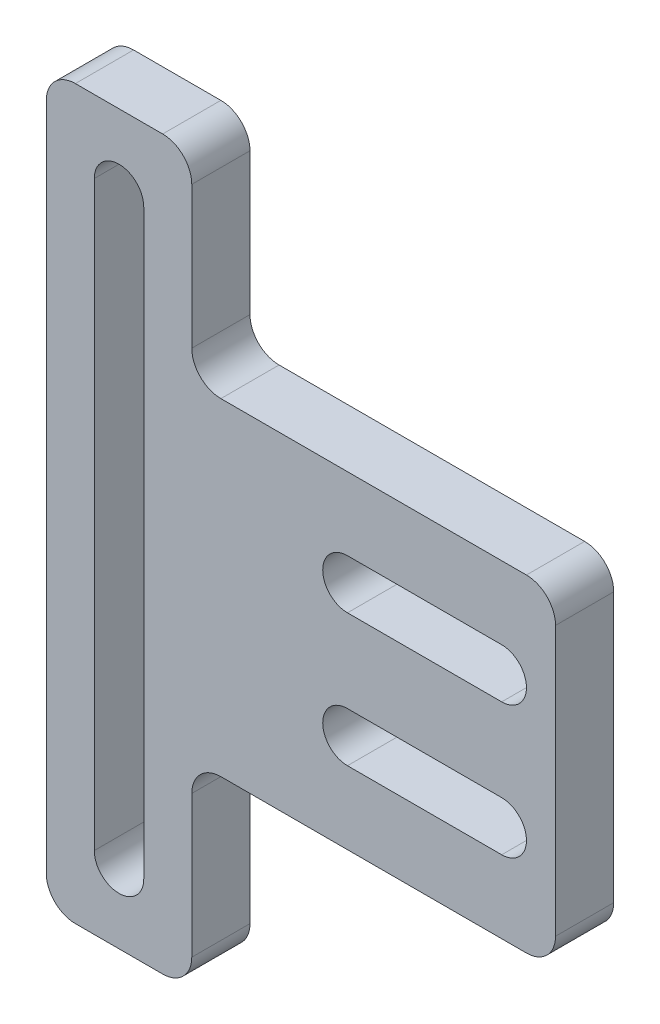
ISO-10303-21;
HEADER;
FILE_DESCRIPTION(('STEP AP214'),'2;1');
FILE_NAME('part.step','',(''),(''),'','','');
FILE_SCHEMA(('AUTOMOTIVE_DESIGN { 1 0 10303 214 1 1 1 1 }'));
ENDSEC;
DATA;
#1=APPLICATION_CONTEXT('core data for automotive mechanical design processes');
#2=APPLICATION_PROTOCOL_DEFINITION('international standard','automotive_design',2000,#1);
#3=PRODUCT_CONTEXT('',#1,'mechanical');
#4=PRODUCT('Part','Part','',(#3));
#5=PRODUCT_RELATED_PRODUCT_CATEGORY('part','',(#4));
#6=PRODUCT_DEFINITION_FORMATION('','',#4);
#7=PRODUCT_DEFINITION_CONTEXT('part definition',#1,'design');
#8=PRODUCT_DEFINITION('design','',#6,#7);
#9=PRODUCT_DEFINITION_SHAPE('','',#8);
#10=(LENGTH_UNIT() NAMED_UNIT(*) SI_UNIT(.MILLI.,.METRE.));
#11=(NAMED_UNIT(*) PLANE_ANGLE_UNIT() SI_UNIT($,.RADIAN.));
#12=(NAMED_UNIT(*) SI_UNIT($,.STERADIAN.) SOLID_ANGLE_UNIT());
#13=UNCERTAINTY_MEASURE_WITH_UNIT(LENGTH_MEASURE(1.E-05),#10,'distance_accuracy_value','');
#14=(GEOMETRIC_REPRESENTATION_CONTEXT(3) GLOBAL_UNCERTAINTY_ASSIGNED_CONTEXT((#13)) GLOBAL_UNIT_ASSIGNED_CONTEXT((#10,
#11,#12)) REPRESENTATION_CONTEXT('',''));
#15=CARTESIAN_POINT('',(0.,0.,0.));
#16=DIRECTION('',(0.,0.,1.));
#17=DIRECTION('',(1.,0.,0.));
#18=AXIS2_PLACEMENT_3D('',#15,#16,#17);
#19=CARTESIAN_POINT('',(0.,0.,2.));
#20=DIRECTION('',(0.,0.,1.));
#21=DIRECTION('',(1.,0.,0.));
#22=AXIS2_PLACEMENT_3D('',#19,#20,#21);
#23=PLANE('',#22);
#24=DIRECTION('',(0.,1.,0.));
#25=VECTOR('',#24,1.);
#26=CARTESIAN_POINT('',(-7.49999999999999,25.,2.));
#27=LINE('',#26,#25);
#28=CARTESIAN_POINT('',(-7.49999999999999,13.25,2.));
#29=VERTEX_POINT('',#28);
#30=CARTESIAN_POINT('',(-7.49999999999999,23.,2.));
#31=VERTEX_POINT('',#30);
#32=EDGE_CURVE('E393',#29,#31,#27,.T.);
#33=ORIENTED_EDGE('',*,*,#32,.T.);
#34=CARTESIAN_POINT('',(-9.49999999999999,23.,2.));
#35=DIRECTION('',(0.,0.,1.));
#36=DIRECTION('',(1.,0.,0.));
#37=AXIS2_PLACEMENT_3D('',#34,#35,#36);
#38=CIRCLE('',#37,2.);
#39=CARTESIAN_POINT('',(-9.49999999999999,25.,2.));
#40=VERTEX_POINT('',#39);
#41=EDGE_CURVE('E478',#31,#40,#38,.T.);
#42=ORIENTED_EDGE('',*,*,#41,.T.);
#43=DIRECTION('',(-1.,0.,0.));
#44=VECTOR('',#43,1.);
#45=CARTESIAN_POINT('',(-17.5,25.,2.));
#46=LINE('',#45,#44);
#47=CARTESIAN_POINT('',(-15.5,25.,2.));
#48=VERTEX_POINT('',#47);
#49=EDGE_CURVE('E397',#40,#48,#46,.T.);
#50=ORIENTED_EDGE('',*,*,#49,.T.);
#51=CARTESIAN_POINT('',(-15.5,23.,2.));
#52=DIRECTION('',(0.,0.,1.));
#53=DIRECTION('',(1.,0.,0.));
#54=AXIS2_PLACEMENT_3D('',#51,#52,#53);
#55=CIRCLE('',#54,2.);
#56=CARTESIAN_POINT('',(-17.5,23.,2.));
#57=VERTEX_POINT('',#56);
#58=EDGE_CURVE('E68',#48,#57,#55,.T.);
#59=ORIENTED_EDGE('',*,*,#58,.T.);
#60=DIRECTION('',(0.,-1.,0.));
#61=VECTOR('',#60,1.);
#62=CARTESIAN_POINT('',(-17.5,-25.,2.));
#63=LINE('',#62,#61);
#64=CARTESIAN_POINT('',(-17.5,-23.,2.));
#65=VERTEX_POINT('',#64);
#66=EDGE_CURVE('E400',#57,#65,#63,.T.);
#67=ORIENTED_EDGE('',*,*,#66,.T.);
#68=CARTESIAN_POINT('',(-15.5,-23.,2.));
#69=DIRECTION('',(0.,0.,1.));
#70=DIRECTION('',(1.,0.,0.));
#71=AXIS2_PLACEMENT_3D('',#68,#69,#70);
#72=CIRCLE('',#71,2.);
#73=CARTESIAN_POINT('',(-15.5,-25.,2.));
#74=VERTEX_POINT('',#73);
#75=EDGE_CURVE('E464',#65,#74,#72,.T.);
#76=ORIENTED_EDGE('',*,*,#75,.T.);
#77=DIRECTION('',(1.,0.,0.));
#78=VECTOR('',#77,1.);
#79=CARTESIAN_POINT('',(-17.5,-25.,2.));
#80=LINE('',#79,#78);
#81=CARTESIAN_POINT('',(-9.49999999999999,-25.,2.));
#82=VERTEX_POINT('',#81);
#83=EDGE_CURVE('E372',#74,#82,#80,.T.);
#84=ORIENTED_EDGE('',*,*,#83,.T.);
#85=CARTESIAN_POINT('',(-9.49999999999999,-23.,2.));
#86=DIRECTION('',(0.,0.,1.));
#87=DIRECTION('',(1.,0.,0.));
#88=AXIS2_PLACEMENT_3D('',#85,#86,#87);
#89=CIRCLE('',#88,2.);
#90=CARTESIAN_POINT('',(-7.49999999999999,-23.,2.));
#91=VERTEX_POINT('',#90);
#92=EDGE_CURVE('E467',#82,#91,#89,.T.);
#93=ORIENTED_EDGE('',*,*,#92,.T.);
#94=DIRECTION('',(0.,1.,0.));
#95=VECTOR('',#94,1.);
#96=CARTESIAN_POINT('',(-7.49999999999999,-25.,2.));
#97=LINE('',#96,#95);
#98=CARTESIAN_POINT('',(-7.49999999999999,-13.25,2.));
#99=VERTEX_POINT('',#98);
#100=EDGE_CURVE('E376',#91,#99,#97,.T.);
#101=ORIENTED_EDGE('',*,*,#100,.T.);
#102=CARTESIAN_POINT('',(-5.49999999999999,-13.25,2.));
#103=DIRECTION('',(0.,0.,1.));
#104=DIRECTION('',(1.,0.,0.));
#105=AXIS2_PLACEMENT_3D('',#102,#103,#104);
#106=CIRCLE('',#105,2.);
#107=CARTESIAN_POINT('',(-5.49999999999999,-11.25,2.));
#108=VERTEX_POINT('',#107);
#109=EDGE_CURVE('E525',#99,#108,#106,.F.);
#110=ORIENTED_EDGE('',*,*,#109,.T.);
#111=DIRECTION('',(1.,0.,0.));
#112=VECTOR('',#111,1.);
#113=CARTESIAN_POINT('',(17.5,-11.25,2.));
#114=LINE('',#113,#112);
#115=CARTESIAN_POINT('',(15.5,-11.25,2.));
#116=VERTEX_POINT('',#115);
#117=EDGE_CURVE('E381',#108,#116,#114,.T.);
#118=ORIENTED_EDGE('',*,*,#117,.T.);
#119=CARTESIAN_POINT('',(15.5,-9.25000000000001,2.));
#120=DIRECTION('',(0.,0.,1.));
#121=DIRECTION('',(1.,0.,0.));
#122=AXIS2_PLACEMENT_3D('',#119,#120,#121);
#123=CIRCLE('',#122,2.);
#124=CARTESIAN_POINT('',(17.5,-9.25000000000001,2.));
#125=VERTEX_POINT('',#124);
#126=EDGE_CURVE('E472',#116,#125,#123,.T.);
#127=ORIENTED_EDGE('',*,*,#126,.T.);
#128=DIRECTION('',(0.,1.,0.));
#129=VECTOR('',#128,1.);
#130=CARTESIAN_POINT('',(17.5,-11.25,2.));
#131=LINE('',#130,#129);
#132=CARTESIAN_POINT('',(17.5,9.25000000000001,2.));
#133=VERTEX_POINT('',#132);
#134=EDGE_CURVE('E385',#125,#133,#131,.T.);
#135=ORIENTED_EDGE('',*,*,#134,.T.);
#136=CARTESIAN_POINT('',(15.5,9.25000000000001,2.));
#137=DIRECTION('',(0.,0.,1.));
#138=DIRECTION('',(1.,0.,0.));
#139=AXIS2_PLACEMENT_3D('',#136,#137,#138);
#140=CIRCLE('',#139,2.);
#141=CARTESIAN_POINT('',(15.5,11.25,2.));
#142=VERTEX_POINT('',#141);
#143=EDGE_CURVE('E475',#133,#142,#140,.T.);
#144=ORIENTED_EDGE('',*,*,#143,.T.);
#145=DIRECTION('',(-1.,0.,0.));
#146=VECTOR('',#145,1.);
#147=CARTESIAN_POINT('',(17.5,11.25,2.));
#148=LINE('',#147,#146);
#149=CARTESIAN_POINT('',(-5.49999999999999,11.25,2.));
#150=VERTEX_POINT('',#149);
#151=EDGE_CURVE('E389',#142,#150,#148,.T.);
#152=ORIENTED_EDGE('',*,*,#151,.T.);
#153=CARTESIAN_POINT('',(-5.49999999999999,13.25,2.));
#154=DIRECTION('',(0.,0.,1.));
#155=DIRECTION('',(1.,0.,0.));
#156=AXIS2_PLACEMENT_3D('',#153,#154,#155);
#157=CIRCLE('',#156,2.);
#158=EDGE_CURVE('E11',#150,#29,#157,.F.);
#159=ORIENTED_EDGE('',*,*,#158,.T.);
#160=EDGE_LOOP('',(#33,#42,#50,#59,#67,#76,#84,#93,#101,#110,#118,#127,#135,#144,#152,#159));
#161=FACE_BOUND('',#160,.T.);
#162=DIRECTION('',(1.,0.,0.));
#163=VECTOR('',#162,1.);
#164=CARTESIAN_POINT('',(3.20000000000002,2.85000000000003,2.));
#165=LINE('',#164,#163);
#166=CARTESIAN_POINT('',(3.20000000000002,2.85000000000003,2.));
#167=VERTEX_POINT('',#166);
#168=CARTESIAN_POINT('',(13.8,2.85000000000003,2.));
#169=VERTEX_POINT('',#168);
#170=EDGE_CURVE('E332',#167,#169,#165,.T.);
#171=ORIENTED_EDGE('',*,*,#170,.F.);
#172=CARTESIAN_POINT('',(3.20000000000001,4.55000000000001,2.));
#173=DIRECTION('',(0.,0.,1.));
#174=DIRECTION('',(1.,0.,0.));
#175=AXIS2_PLACEMENT_3D('',#172,#173,#174);
#176=CIRCLE('',#175,1.69999999999998);
#177=CARTESIAN_POINT('',(3.20000000000002,6.24999999999999,2.));
#178=VERTEX_POINT('',#177);
#179=EDGE_CURVE('E329',#178,#167,#176,.T.);
#180=ORIENTED_EDGE('',*,*,#179,.F.);
#181=DIRECTION('',(-1.,0.,0.));
#182=VECTOR('',#181,1.);
#183=CARTESIAN_POINT('',(3.20000000000002,6.24999999999999,2.));
#184=LINE('',#183,#182);
#185=CARTESIAN_POINT('',(13.8,6.24999999999999,2.));
#186=VERTEX_POINT('',#185);
#187=EDGE_CURVE('E340',#186,#178,#184,.T.);
#188=ORIENTED_EDGE('',*,*,#187,.F.);
#189=CARTESIAN_POINT('',(13.8,4.55000000000001,2.));
#190=DIRECTION('',(0.,0.,1.));
#191=DIRECTION('',(1.,0.,0.));
#192=AXIS2_PLACEMENT_3D('',#189,#190,#191);
#193=CIRCLE('',#192,1.69999999999998);
#194=EDGE_CURVE('E336',#169,#186,#193,.T.);
#195=ORIENTED_EDGE('',*,*,#194,.F.);
#196=EDGE_LOOP('',(#171,#180,#188,#195));
#197=FACE_BOUND('',#196,.T.);
#198=DIRECTION('',(1.,0.,0.));
#199=VECTOR('',#198,1.);
#200=CARTESIAN_POINT('',(3.20000000000002,-6.24999999999999,2.));
#201=LINE('',#200,#199);
#202=CARTESIAN_POINT('',(3.20000000000002,-6.24999999999999,2.));
#203=VERTEX_POINT('',#202);
#204=CARTESIAN_POINT('',(13.8,-6.24999999999999,2.));
#205=VERTEX_POINT('',#204);
#206=EDGE_CURVE('E289',#203,#205,#201,.T.);
#207=ORIENTED_EDGE('',*,*,#206,.F.);
#208=CARTESIAN_POINT('',(3.20000000000001,-4.54999999999999,2.));
#209=DIRECTION('',(0.,0.,1.));
#210=DIRECTION('',(-1.,0.,0.));
#211=AXIS2_PLACEMENT_3D('',#208,#209,#210);
#212=CIRCLE('',#211,1.69999999999998);
#213=CARTESIAN_POINT('',(3.20000000000002,-2.85000000000003,2.));
#214=VERTEX_POINT('',#213);
#215=EDGE_CURVE('E286',#214,#203,#212,.T.);
#216=ORIENTED_EDGE('',*,*,#215,.F.);
#217=DIRECTION('',(-1.,0.,0.));
#218=VECTOR('',#217,1.);
#219=CARTESIAN_POINT('',(3.20000000000002,-2.85000000000003,2.));
#220=LINE('',#219,#218);
#221=CARTESIAN_POINT('',(13.8,-2.85000000000002,2.));
#222=VERTEX_POINT('',#221);
#223=EDGE_CURVE('E297',#222,#214,#220,.T.);
#224=ORIENTED_EDGE('',*,*,#223,.F.);
#225=CARTESIAN_POINT('',(13.8,-4.54999999999999,2.));
#226=DIRECTION('',(0.,0.,1.));
#227=DIRECTION('',(-1.,0.,0.));
#228=AXIS2_PLACEMENT_3D('',#225,#226,#227);
#229=CIRCLE('',#228,1.69999999999998);
#230=EDGE_CURVE('E293',#205,#222,#229,.T.);
#231=ORIENTED_EDGE('',*,*,#230,.F.);
#232=EDGE_LOOP('',(#207,#216,#224,#231));
#233=FACE_BOUND('',#232,.T.);
#234=DIRECTION('',(0.,-1.,0.));
#235=VECTOR('',#234,1.);
#236=CARTESIAN_POINT('',(-14.2,20.,2.));
#237=LINE('',#236,#235);
#238=CARTESIAN_POINT('',(-14.2,20.,2.));
#239=VERTEX_POINT('',#238);
#240=CARTESIAN_POINT('',(-14.2,-20.,2.));
#241=VERTEX_POINT('',#240);
#242=EDGE_CURVE('E244',#239,#241,#237,.T.);
#243=ORIENTED_EDGE('',*,*,#242,.F.);
#244=CARTESIAN_POINT('',(-12.5,20.,2.));
#245=DIRECTION('',(0.,0.,1.));
#246=DIRECTION('',(1.,0.,0.));
#247=AXIS2_PLACEMENT_3D('',#244,#245,#246);
#248=CIRCLE('',#247,1.7);
#249=CARTESIAN_POINT('',(-10.8,20.,2.));
#250=VERTEX_POINT('',#249);
#251=EDGE_CURVE('E233',#250,#239,#248,.T.);
#252=ORIENTED_EDGE('',*,*,#251,.F.);
#253=DIRECTION('',(0.,1.,0.));
#254=VECTOR('',#253,1.);
#255=CARTESIAN_POINT('',(-10.8,20.,2.));
#256=LINE('',#255,#254);
#257=CARTESIAN_POINT('',(-10.8,-20.,2.));
#258=VERTEX_POINT('',#257);
#259=EDGE_CURVE('E262',#258,#250,#256,.T.);
#260=ORIENTED_EDGE('',*,*,#259,.F.);
#261=CARTESIAN_POINT('',(-12.5,-20.,2.));
#262=DIRECTION('',(0.,0.,1.));
#263=DIRECTION('',(1.,0.,0.));
#264=AXIS2_PLACEMENT_3D('',#261,#262,#263);
#265=CIRCLE('',#264,1.7);
#266=EDGE_CURVE('E258',#241,#258,#265,.T.);
#267=ORIENTED_EDGE('',*,*,#266,.F.);
#268=EDGE_LOOP('',(#243,#252,#260,#267));
#269=FACE_BOUND('',#268,.T.);
#270=ADVANCED_FACE('F45',(#161,#197,#233,#269),#23,.T.);
#271=CARTESIAN_POINT('',(0.,0.,-2.));
#272=DIRECTION('',(0.,0.,1.));
#273=DIRECTION('',(1.,0.,0.));
#274=AXIS2_PLACEMENT_3D('',#271,#272,#273);
#275=PLANE('',#274);
#276=CARTESIAN_POINT('',(3.20000000000001,-4.54999999999999,-2.));
#277=DIRECTION('',(0.,0.,1.));
#278=DIRECTION('',(-1.,0.,0.));
#279=AXIS2_PLACEMENT_3D('',#276,#277,#278);
#280=CIRCLE('',#279,1.69999999999998);
#281=CARTESIAN_POINT('',(3.20000000000002,-2.85000000000003,-2.));
#282=VERTEX_POINT('',#281);
#283=CARTESIAN_POINT('',(3.20000000000002,-6.24999999999999,-2.));
#284=VERTEX_POINT('',#283);
#285=EDGE_CURVE('E253',#282,#284,#280,.T.);
#286=ORIENTED_EDGE('',*,*,#285,.T.);
#287=DIRECTION('',(1.,0.,0.));
#288=VECTOR('',#287,1.);
#289=CARTESIAN_POINT('',(3.20000000000002,-6.24999999999999,-2.));
#290=LINE('',#289,#288);
#291=CARTESIAN_POINT('',(13.8,-6.24999999999999,-2.));
#292=VERTEX_POINT('',#291);
#293=EDGE_CURVE('E304',#284,#292,#290,.T.);
#294=ORIENTED_EDGE('',*,*,#293,.T.);
#295=CARTESIAN_POINT('',(13.8,-4.54999999999999,-2.));
#296=DIRECTION('',(0.,0.,1.));
#297=DIRECTION('',(-1.,0.,0.));
#298=AXIS2_PLACEMENT_3D('',#295,#296,#297);
#299=CIRCLE('',#298,1.69999999999998);
#300=CARTESIAN_POINT('',(13.8,-2.85000000000001,-2.));
#301=VERTEX_POINT('',#300);
#302=EDGE_CURVE('E308',#292,#301,#299,.T.);
#303=ORIENTED_EDGE('',*,*,#302,.T.);
#304=DIRECTION('',(-1.,0.,0.));
#305=VECTOR('',#304,1.);
#306=CARTESIAN_POINT('',(3.20000000000002,-2.85000000000003,-2.));
#307=LINE('',#306,#305);
#308=EDGE_CURVE('E290',#301,#282,#307,.T.);
#309=ORIENTED_EDGE('',*,*,#308,.T.);
#310=EDGE_LOOP('',(#286,#294,#303,#309));
#311=FACE_BOUND('',#310,.T.);
#312=DIRECTION('',(-1.,0.,0.));
#313=VECTOR('',#312,1.);
#314=CARTESIAN_POINT('',(-17.5,25.,-2.));
#315=LINE('',#314,#313);
#316=CARTESIAN_POINT('',(-9.49999999999999,25.,-2.));
#317=VERTEX_POINT('',#316);
#318=CARTESIAN_POINT('',(-15.5,25.,-2.));
#319=VERTEX_POINT('',#318);
#320=EDGE_CURVE('E427',#317,#319,#315,.T.);
#321=ORIENTED_EDGE('',*,*,#320,.F.);
#322=CARTESIAN_POINT('',(-9.49999999999999,23.,-2.));
#323=DIRECTION('',(0.,0.,1.));
#324=DIRECTION('',(1.,0.,0.));
#325=AXIS2_PLACEMENT_3D('',#322,#323,#324);
#326=CIRCLE('',#325,2.);
#327=CARTESIAN_POINT('',(-7.49999999999999,23.,-2.));
#328=VERTEX_POINT('',#327);
#329=EDGE_CURVE('E454',#317,#328,#326,.F.);
#330=ORIENTED_EDGE('',*,*,#329,.T.);
#331=DIRECTION('',(0.,1.,0.));
#332=VECTOR('',#331,1.);
#333=CARTESIAN_POINT('',(-7.49999999999999,25.,-2.));
#334=LINE('',#333,#332);
#335=CARTESIAN_POINT('',(-7.49999999999999,13.25,-2.));
#336=VERTEX_POINT('',#335);
#337=EDGE_CURVE('E423',#336,#328,#334,.T.);
#338=ORIENTED_EDGE('',*,*,#337,.F.);
#339=CARTESIAN_POINT('',(-5.49999999999999,13.25,-2.));
#340=DIRECTION('',(0.,0.,1.));
#341=DIRECTION('',(1.,0.,0.));
#342=AXIS2_PLACEMENT_3D('',#339,#340,#341);
#343=CIRCLE('',#342,2.);
#344=CARTESIAN_POINT('',(-5.49999999999999,11.25,-2.));
#345=VERTEX_POINT('',#344);
#346=EDGE_CURVE('E54',#336,#345,#343,.T.);
#347=ORIENTED_EDGE('',*,*,#346,.T.);
#348=DIRECTION('',(-1.,0.,0.));
#349=VECTOR('',#348,1.);
#350=CARTESIAN_POINT('',(17.5,11.25,-2.));
#351=LINE('',#350,#349);
#352=CARTESIAN_POINT('',(15.5,11.25,-2.));
#353=VERTEX_POINT('',#352);
#354=EDGE_CURVE('E419',#353,#345,#351,.T.);
#355=ORIENTED_EDGE('',*,*,#354,.F.);
#356=CARTESIAN_POINT('',(15.5,9.25000000000001,-2.));
#357=DIRECTION('',(0.,0.,1.));
#358=DIRECTION('',(1.,0.,0.));
#359=AXIS2_PLACEMENT_3D('',#356,#357,#358);
#360=CIRCLE('',#359,2.);
#361=CARTESIAN_POINT('',(17.5,9.25000000000001,-2.));
#362=VERTEX_POINT('',#361);
#363=EDGE_CURVE('E451',#353,#362,#360,.F.);
#364=ORIENTED_EDGE('',*,*,#363,.T.);
#365=DIRECTION('',(0.,1.,0.));
#366=VECTOR('',#365,1.);
#367=CARTESIAN_POINT('',(17.5,-11.25,-2.));
#368=LINE('',#367,#366);
#369=CARTESIAN_POINT('',(17.5,-9.25000000000001,-2.));
#370=VERTEX_POINT('',#369);
#371=EDGE_CURVE('E415',#370,#362,#368,.T.);
#372=ORIENTED_EDGE('',*,*,#371,.F.);
#373=CARTESIAN_POINT('',(15.5,-9.25000000000001,-2.));
#374=DIRECTION('',(0.,0.,1.));
#375=DIRECTION('',(1.,0.,0.));
#376=AXIS2_PLACEMENT_3D('',#373,#374,#375);
#377=CIRCLE('',#376,2.);
#378=CARTESIAN_POINT('',(15.5,-11.25,-2.));
#379=VERTEX_POINT('',#378);
#380=EDGE_CURVE('E448',#370,#379,#377,.F.);
#381=ORIENTED_EDGE('',*,*,#380,.T.);
#382=DIRECTION('',(1.,0.,0.));
#383=VECTOR('',#382,1.);
#384=CARTESIAN_POINT('',(17.5,-11.25,-2.));
#385=LINE('',#384,#383);
#386=CARTESIAN_POINT('',(-5.49999999999999,-11.25,-2.));
#387=VERTEX_POINT('',#386);
#388=EDGE_CURVE('E411',#387,#379,#385,.T.);
#389=ORIENTED_EDGE('',*,*,#388,.F.);
#390=CARTESIAN_POINT('',(-5.49999999999999,-13.25,-2.));
#391=DIRECTION('',(0.,0.,1.));
#392=DIRECTION('',(1.,0.,0.));
#393=AXIS2_PLACEMENT_3D('',#390,#391,#392);
#394=CIRCLE('',#393,2.);
#395=CARTESIAN_POINT('',(-7.49999999999999,-13.25,-2.));
#396=VERTEX_POINT('',#395);
#397=EDGE_CURVE('E522',#387,#396,#394,.T.);
#398=ORIENTED_EDGE('',*,*,#397,.T.);
#399=DIRECTION('',(0.,1.,0.));
#400=VECTOR('',#399,1.);
#401=CARTESIAN_POINT('',(-7.49999999999999,-25.,-2.));
#402=LINE('',#401,#400);
#403=CARTESIAN_POINT('',(-7.49999999999999,-23.,-2.));
#404=VERTEX_POINT('',#403);
#405=EDGE_CURVE('E407',#404,#396,#402,.T.);
#406=ORIENTED_EDGE('',*,*,#405,.F.);
#407=CARTESIAN_POINT('',(-9.49999999999999,-23.,-2.));
#408=DIRECTION('',(0.,0.,1.));
#409=DIRECTION('',(1.,0.,0.));
#410=AXIS2_PLACEMENT_3D('',#407,#408,#409);
#411=CIRCLE('',#410,2.);
#412=CARTESIAN_POINT('',(-9.49999999999999,-25.,-2.));
#413=VERTEX_POINT('',#412);
#414=EDGE_CURVE('E442',#404,#413,#411,.F.);
#415=ORIENTED_EDGE('',*,*,#414,.T.);
#416=DIRECTION('',(1.,0.,0.));
#417=VECTOR('',#416,1.);
#418=CARTESIAN_POINT('',(-17.5,-25.,-2.));
#419=LINE('',#418,#417);
#420=CARTESIAN_POINT('',(-15.5,-25.,-2.));
#421=VERTEX_POINT('',#420);
#422=EDGE_CURVE('E371',#421,#413,#419,.T.);
#423=ORIENTED_EDGE('',*,*,#422,.F.);
#424=CARTESIAN_POINT('',(-15.5,-23.,-2.));
#425=DIRECTION('',(0.,0.,1.));
#426=DIRECTION('',(1.,0.,0.));
#427=AXIS2_PLACEMENT_3D('',#424,#425,#426);
#428=CIRCLE('',#427,2.);
#429=CARTESIAN_POINT('',(-17.5,-23.,-2.));
#430=VERTEX_POINT('',#429);
#431=EDGE_CURVE('E439',#421,#430,#428,.F.);
#432=ORIENTED_EDGE('',*,*,#431,.T.);
#433=DIRECTION('',(0.,-1.,0.));
#434=VECTOR('',#433,1.);
#435=CARTESIAN_POINT('',(-17.5,-25.,-2.));
#436=LINE('',#435,#434);
#437=CARTESIAN_POINT('',(-17.5,23.,-2.));
#438=VERTEX_POINT('',#437);
#439=EDGE_CURVE('E377',#438,#430,#436,.T.);
#440=ORIENTED_EDGE('',*,*,#439,.F.);
#441=CARTESIAN_POINT('',(-15.5,23.,-2.));
#442=DIRECTION('',(0.,0.,1.));
#443=DIRECTION('',(1.,0.,0.));
#444=AXIS2_PLACEMENT_3D('',#441,#442,#443);
#445=CIRCLE('',#444,2.);
#446=EDGE_CURVE('E445',#438,#319,#445,.F.);
#447=ORIENTED_EDGE('',*,*,#446,.T.);
#448=EDGE_LOOP('',(#321,#330,#338,#347,#355,#364,#372,#381,#389,#398,#406,#415,#423,#432,#440,#447));
#449=FACE_BOUND('',#448,.T.);
#450=CARTESIAN_POINT('',(3.20000000000001,4.55000000000001,-2.));
#451=DIRECTION('',(0.,0.,1.));
#452=DIRECTION('',(1.,0.,0.));
#453=AXIS2_PLACEMENT_3D('',#450,#451,#452);
#454=CIRCLE('',#453,1.69999999999998);
#455=CARTESIAN_POINT('',(3.20000000000002,6.24999999999999,-2.));
#456=VERTEX_POINT('',#455);
#457=CARTESIAN_POINT('',(3.20000000000002,2.85000000000003,-2.));
#458=VERTEX_POINT('',#457);
#459=EDGE_CURVE('E328',#456,#458,#454,.T.);
#460=ORIENTED_EDGE('',*,*,#459,.T.);
#461=DIRECTION('',(1.,0.,0.));
#462=VECTOR('',#461,1.);
#463=CARTESIAN_POINT('',(3.20000000000002,2.85000000000003,-2.));
#464=LINE('',#463,#462);
#465=CARTESIAN_POINT('',(13.8,2.85000000000003,-2.));
#466=VERTEX_POINT('',#465);
#467=EDGE_CURVE('E347',#458,#466,#464,.T.);
#468=ORIENTED_EDGE('',*,*,#467,.T.);
#469=CARTESIAN_POINT('',(13.8,4.55000000000001,-2.));
#470=DIRECTION('',(0.,0.,1.));
#471=DIRECTION('',(1.,0.,0.));
#472=AXIS2_PLACEMENT_3D('',#469,#470,#471);
#473=CIRCLE('',#472,1.69999999999998);
#474=CARTESIAN_POINT('',(13.8,6.24999999999999,-2.));
#475=VERTEX_POINT('',#474);
#476=EDGE_CURVE('E351',#466,#475,#473,.T.);
#477=ORIENTED_EDGE('',*,*,#476,.T.);
#478=DIRECTION('',(-1.,0.,0.));
#479=VECTOR('',#478,1.);
#480=CARTESIAN_POINT('',(3.20000000000002,6.24999999999999,-2.));
#481=LINE('',#480,#479);
#482=EDGE_CURVE('E333',#475,#456,#481,.T.);
#483=ORIENTED_EDGE('',*,*,#482,.T.);
#484=EDGE_LOOP('',(#460,#468,#477,#483));
#485=FACE_BOUND('',#484,.T.);
#486=CARTESIAN_POINT('',(-12.5,20.,-2.));
#487=DIRECTION('',(0.,0.,1.));
#488=DIRECTION('',(1.,0.,0.));
#489=AXIS2_PLACEMENT_3D('',#486,#487,#488);
#490=CIRCLE('',#489,1.7);
#491=CARTESIAN_POINT('',(-10.8,20.,-2.));
#492=VERTEX_POINT('',#491);
#493=CARTESIAN_POINT('',(-14.2,20.,-2.));
#494=VERTEX_POINT('',#493);
#495=EDGE_CURVE('E267',#492,#494,#490,.T.);
#496=ORIENTED_EDGE('',*,*,#495,.T.);
#497=DIRECTION('',(0.,-1.,0.));
#498=VECTOR('',#497,1.);
#499=CARTESIAN_POINT('',(-14.2,20.,-2.));
#500=LINE('',#499,#498);
#501=CARTESIAN_POINT('',(-14.2,-20.,-2.));
#502=VERTEX_POINT('',#501);
#503=EDGE_CURVE('E251',#494,#502,#500,.T.);
#504=ORIENTED_EDGE('',*,*,#503,.T.);
#505=CARTESIAN_POINT('',(-12.5,-20.,-2.));
#506=DIRECTION('',(0.,0.,1.));
#507=DIRECTION('',(1.,0.,0.));
#508=AXIS2_PLACEMENT_3D('',#505,#506,#507);
#509=CIRCLE('',#508,1.7);
#510=CARTESIAN_POINT('',(-10.8,-20.,-2.));
#511=VERTEX_POINT('',#510);
#512=EDGE_CURVE('E272',#502,#511,#509,.T.);
#513=ORIENTED_EDGE('',*,*,#512,.T.);
#514=DIRECTION('',(0.,1.,0.));
#515=VECTOR('',#514,1.);
#516=CARTESIAN_POINT('',(-10.8,20.,-2.));
#517=LINE('',#516,#515);
#518=EDGE_CURVE('E245',#511,#492,#517,.T.);
#519=ORIENTED_EDGE('',*,*,#518,.T.);
#520=EDGE_LOOP('',(#496,#504,#513,#519));
#521=FACE_BOUND('',#520,.T.);
#522=ADVANCED_FACE('F532',(#311,#449,#485,#521),#275,.F.);
#523=CARTESIAN_POINT('',(-17.5,-25.,2.));
#524=DIRECTION('',(0.,1.,0.));
#525=DIRECTION('',(0.,0.,1.));
#526=AXIS2_PLACEMENT_3D('',#523,#524,#525);
#527=PLANE('',#526);
#528=ORIENTED_EDGE('',*,*,#422,.T.);
#529=DIRECTION('',(0.,0.,-1.));
#530=VECTOR('',#529,1.);
#531=CARTESIAN_POINT('',(-9.49999999999999,-25.,2.));
#532=LINE('',#531,#530);
#533=EDGE_CURVE('E519',#413,#82,#532,.F.);
#534=ORIENTED_EDGE('',*,*,#533,.T.);
#535=ORIENTED_EDGE('',*,*,#83,.F.);
#536=DIRECTION('',(0.,0.,-1.));
#537=VECTOR('',#536,1.);
#538=CARTESIAN_POINT('',(-15.5,-25.,2.));
#539=LINE('',#538,#537);
#540=EDGE_CURVE('E515',#74,#421,#539,.T.);
#541=ORIENTED_EDGE('',*,*,#540,.T.);
#542=EDGE_LOOP('',(#528,#534,#535,#541));
#543=FACE_BOUND('',#542,.T.);
#544=ADVANCED_FACE('F567',(#543),#527,.F.);
#545=CARTESIAN_POINT('',(-7.49999999999999,-25.,2.));
#546=DIRECTION('',(-1.,0.,0.));
#547=DIRECTION('',(0.,-1.,0.));
#548=AXIS2_PLACEMENT_3D('',#545,#546,#547);
#549=PLANE('',#548);
#550=ORIENTED_EDGE('',*,*,#405,.T.);
#551=DIRECTION('',(0.,0.,-1.));
#552=VECTOR('',#551,1.);
#553=CARTESIAN_POINT('',(-7.49999999999999,-13.25,2.));
#554=LINE('',#553,#552);
#555=EDGE_CURVE('E506',#396,#99,#554,.F.);
#556=ORIENTED_EDGE('',*,*,#555,.T.);
#557=ORIENTED_EDGE('',*,*,#100,.F.);
#558=DIRECTION('',(0.,0.,-1.));
#559=VECTOR('',#558,1.);
#560=CARTESIAN_POINT('',(-7.49999999999999,-23.,2.));
#561=LINE('',#560,#559);
#562=EDGE_CURVE('E502',#91,#404,#561,.T.);
#563=ORIENTED_EDGE('',*,*,#562,.T.);
#564=EDGE_LOOP('',(#550,#556,#557,#563));
#565=FACE_BOUND('',#564,.T.);
#566=ADVANCED_FACE('F576',(#565),#549,.F.);
#567=CARTESIAN_POINT('',(17.5,-11.25,2.));
#568=DIRECTION('',(0.,1.,0.));
#569=DIRECTION('',(0.,0.,1.));
#570=AXIS2_PLACEMENT_3D('',#567,#568,#569);
#571=PLANE('',#570);
#572=ORIENTED_EDGE('',*,*,#388,.T.);
#573=DIRECTION('',(0.,0.,-1.));
#574=VECTOR('',#573,1.);
#575=CARTESIAN_POINT('',(15.5,-11.25,2.));
#576=LINE('',#575,#574);
#577=EDGE_CURVE('E499',#379,#116,#576,.F.);
#578=ORIENTED_EDGE('',*,*,#577,.T.);
#579=ORIENTED_EDGE('',*,*,#117,.F.);
#580=DIRECTION('',(0.,0.,-1.));
#581=VECTOR('',#580,1.);
#582=CARTESIAN_POINT('',(-5.49999999999999,-11.25,-2.));
#583=LINE('',#582,#581);
#584=EDGE_CURVE('E495',#108,#387,#583,.T.);
#585=ORIENTED_EDGE('',*,*,#584,.T.);
#586=EDGE_LOOP('',(#572,#578,#579,#585));
#587=FACE_BOUND('',#586,.T.);
#588=ADVANCED_FACE('F585',(#587),#571,.F.);
#589=CARTESIAN_POINT('',(17.5,-11.25,2.));
#590=DIRECTION('',(-1.,0.,0.));
#591=DIRECTION('',(0.,0.,1.));
#592=AXIS2_PLACEMENT_3D('',#589,#590,#591);
#593=PLANE('',#592);
#594=ORIENTED_EDGE('',*,*,#371,.T.);
#595=DIRECTION('',(0.,0.,-1.));
#596=VECTOR('',#595,1.);
#597=CARTESIAN_POINT('',(17.5,9.25000000000001,2.));
#598=LINE('',#597,#596);
#599=EDGE_CURVE('E492',#362,#133,#598,.F.);
#600=ORIENTED_EDGE('',*,*,#599,.T.);
#601=ORIENTED_EDGE('',*,*,#134,.F.);
#602=DIRECTION('',(0.,0.,-1.));
#603=VECTOR('',#602,1.);
#604=CARTESIAN_POINT('',(17.5,-9.25000000000001,2.));
#605=LINE('',#604,#603);
#606=EDGE_CURVE('E488',#125,#370,#605,.T.);
#607=ORIENTED_EDGE('',*,*,#606,.T.);
#608=EDGE_LOOP('',(#594,#600,#601,#607));
#609=FACE_BOUND('',#608,.T.);
#610=ADVANCED_FACE('F594',(#609),#593,.F.);
#611=CARTESIAN_POINT('',(17.5,11.25,2.));
#612=DIRECTION('',(0.,-1.,0.));
#613=DIRECTION('',(0.,0.,-1.));
#614=AXIS2_PLACEMENT_3D('',#611,#612,#613);
#615=PLANE('',#614);
#616=ORIENTED_EDGE('',*,*,#151,.F.);
#617=DIRECTION('',(0.,0.,-1.));
#618=VECTOR('',#617,1.);
#619=CARTESIAN_POINT('',(15.5,11.25,2.));
#620=LINE('',#619,#618);
#621=EDGE_CURVE('E484',#142,#353,#620,.T.);
#622=ORIENTED_EDGE('',*,*,#621,.T.);
#623=ORIENTED_EDGE('',*,*,#354,.T.);
#624=DIRECTION('',(0.,0.,-1.));
#625=VECTOR('',#624,1.);
#626=CARTESIAN_POINT('',(-5.49999999999999,11.25,2.));
#627=LINE('',#626,#625);
#628=EDGE_CURVE('E481',#345,#150,#627,.F.);
#629=ORIENTED_EDGE('',*,*,#628,.T.);
#630=EDGE_LOOP('',(#616,#622,#623,#629));
#631=FACE_BOUND('',#630,.T.);
#632=ADVANCED_FACE('F539',(#631),#615,.F.);
#633=CARTESIAN_POINT('',(-7.49999999999999,25.,2.));
#634=DIRECTION('',(-1.,0.,0.));
#635=DIRECTION('',(0.,-1.,0.));
#636=AXIS2_PLACEMENT_3D('',#633,#634,#635);
#637=PLANE('',#636);
#638=ORIENTED_EDGE('',*,*,#337,.T.);
#639=DIRECTION('',(0.,0.,-1.));
#640=VECTOR('',#639,1.);
#641=CARTESIAN_POINT('',(-7.49999999999999,23.,2.));
#642=LINE('',#641,#640);
#643=EDGE_CURVE('E461',#328,#31,#642,.F.);
#644=ORIENTED_EDGE('',*,*,#643,.T.);
#645=ORIENTED_EDGE('',*,*,#32,.F.);
#646=DIRECTION('',(0.,0.,-1.));
#647=VECTOR('',#646,1.);
#648=CARTESIAN_POINT('',(-7.49999999999999,13.25,-2.));
#649=LINE('',#648,#647);
#650=EDGE_CURVE('E457',#29,#336,#649,.T.);
#651=ORIENTED_EDGE('',*,*,#650,.T.);
#652=EDGE_LOOP('',(#638,#644,#645,#651));
#653=FACE_BOUND('',#652,.T.);
#654=ADVANCED_FACE('F547',(#653),#637,.F.);
#655=CARTESIAN_POINT('',(-17.5,25.,2.));
#656=DIRECTION('',(0.,-1.,0.));
#657=DIRECTION('',(0.,0.,-1.));
#658=AXIS2_PLACEMENT_3D('',#655,#656,#657);
#659=PLANE('',#658);
#660=ORIENTED_EDGE('',*,*,#49,.F.);
#661=DIRECTION('',(0.,0.,-1.));
#662=VECTOR('',#661,1.);
#663=CARTESIAN_POINT('',(-9.49999999999999,25.,2.));
#664=LINE('',#663,#662);
#665=EDGE_CURVE('E435',#40,#317,#664,.T.);
#666=ORIENTED_EDGE('',*,*,#665,.T.);
#667=ORIENTED_EDGE('',*,*,#320,.T.);
#668=DIRECTION('',(0.,0.,-1.));
#669=VECTOR('',#668,1.);
#670=CARTESIAN_POINT('',(-15.5,25.,2.));
#671=LINE('',#670,#669);
#672=EDGE_CURVE('E403',#319,#48,#671,.F.);
#673=ORIENTED_EDGE('',*,*,#672,.T.);
#674=EDGE_LOOP('',(#660,#666,#667,#673));
#675=FACE_BOUND('',#674,.T.);
#676=ADVANCED_FACE('F554',(#675),#659,.F.);
#677=CARTESIAN_POINT('',(-17.5,-25.,2.));
#678=DIRECTION('',(1.,0.,0.));
#679=DIRECTION('',(0.,0.,-1.));
#680=AXIS2_PLACEMENT_3D('',#677,#678,#679);
#681=PLANE('',#680);
#682=ORIENTED_EDGE('',*,*,#66,.F.);
#683=DIRECTION('',(0.,0.,-1.));
#684=VECTOR('',#683,1.);
#685=CARTESIAN_POINT('',(-17.5,23.,2.));
#686=LINE('',#685,#684);
#687=EDGE_CURVE('E511',#57,#438,#686,.T.);
#688=ORIENTED_EDGE('',*,*,#687,.T.);
#689=ORIENTED_EDGE('',*,*,#439,.T.);
#690=DIRECTION('',(0.,0.,-1.));
#691=VECTOR('',#690,1.);
#692=CARTESIAN_POINT('',(-17.5,-23.,2.));
#693=LINE('',#692,#691);
#694=EDGE_CURVE('E61',#430,#65,#693,.F.);
#695=ORIENTED_EDGE('',*,*,#694,.T.);
#696=EDGE_LOOP('',(#682,#688,#689,#695));
#697=FACE_BOUND('',#696,.T.);
#698=ADVANCED_FACE('F560',(#697),#681,.F.);
#699=CARTESIAN_POINT('',(3.20000000000001,4.55000000000001,2.));
#700=DIRECTION('',(0.,0.,-1.));
#701=DIRECTION('',(-1.,0.,0.));
#702=AXIS2_PLACEMENT_3D('',#699,#700,#701);
#703=CYLINDRICAL_SURFACE('',#702,1.69999999999998);
#704=ORIENTED_EDGE('',*,*,#459,.F.);
#705=DIRECTION('',(0.,0.,-1.));
#706=VECTOR('',#705,1.);
#707=CARTESIAN_POINT('',(3.20000000000002,6.24999999999999,2.));
#708=LINE('',#707,#706);
#709=EDGE_CURVE('E343',#178,#456,#708,.T.);
#710=ORIENTED_EDGE('',*,*,#709,.F.);
#711=ORIENTED_EDGE('',*,*,#179,.T.);
#712=DIRECTION('',(0.,0.,-1.));
#713=VECTOR('',#712,1.);
#714=CARTESIAN_POINT('',(3.20000000000002,2.85000000000003,2.));
#715=LINE('',#714,#713);
#716=EDGE_CURVE('E367',#167,#458,#715,.T.);
#717=ORIENTED_EDGE('',*,*,#716,.T.);
#718=EDGE_LOOP('',(#704,#710,#711,#717));
#719=FACE_BOUND('',#718,.T.);
#720=ADVANCED_FACE('F616',(#719),#703,.F.);
#721=CARTESIAN_POINT('',(3.20000000000002,2.85000000000003,2.));
#722=DIRECTION('',(0.,1.,0.));
#723=DIRECTION('',(-1.,0.,0.));
#724=AXIS2_PLACEMENT_3D('',#721,#722,#723);
#725=PLANE('',#724);
#726=ORIENTED_EDGE('',*,*,#467,.F.);
#727=ORIENTED_EDGE('',*,*,#716,.F.);
#728=ORIENTED_EDGE('',*,*,#170,.T.);
#729=DIRECTION('',(0.,0.,-1.));
#730=VECTOR('',#729,1.);
#731=CARTESIAN_POINT('',(13.8,2.85000000000003,2.));
#732=LINE('',#731,#730);
#733=EDGE_CURVE('E364',#169,#466,#732,.T.);
#734=ORIENTED_EDGE('',*,*,#733,.T.);
#735=EDGE_LOOP('',(#726,#727,#728,#734));
#736=FACE_BOUND('',#735,.T.);
#737=ADVANCED_FACE('F673',(#736),#725,.T.);
#738=CARTESIAN_POINT('',(13.8,4.55000000000001,2.));
#739=DIRECTION('',(0.,0.,-1.));
#740=DIRECTION('',(-1.,0.,0.));
#741=AXIS2_PLACEMENT_3D('',#738,#739,#740);
#742=CYLINDRICAL_SURFACE('',#741,1.69999999999998);
#743=ORIENTED_EDGE('',*,*,#476,.F.);
#744=ORIENTED_EDGE('',*,*,#733,.F.);
#745=ORIENTED_EDGE('',*,*,#194,.T.);
#746=DIRECTION('',(0.,0.,-1.));
#747=VECTOR('',#746,1.);
#748=CARTESIAN_POINT('',(13.8,6.24999999999999,2.));
#749=LINE('',#748,#747);
#750=EDGE_CURVE('E361',#186,#475,#749,.T.);
#751=ORIENTED_EDGE('',*,*,#750,.T.);
#752=EDGE_LOOP('',(#743,#744,#745,#751));
#753=FACE_BOUND('',#752,.T.);
#754=ADVANCED_FACE('F680',(#753),#742,.F.);
#755=CARTESIAN_POINT('',(3.20000000000002,6.24999999999999,2.));
#756=DIRECTION('',(0.,-1.,0.));
#757=DIRECTION('',(1.,0.,0.));
#758=AXIS2_PLACEMENT_3D('',#755,#756,#757);
#759=PLANE('',#758);
#760=ORIENTED_EDGE('',*,*,#482,.F.);
#761=ORIENTED_EDGE('',*,*,#750,.F.);
#762=ORIENTED_EDGE('',*,*,#187,.T.);
#763=ORIENTED_EDGE('',*,*,#709,.T.);
#764=EDGE_LOOP('',(#760,#761,#762,#763));
#765=FACE_BOUND('',#764,.T.);
#766=ADVANCED_FACE('F687',(#765),#759,.T.);
#767=CARTESIAN_POINT('',(3.20000000000001,-4.54999999999999,2.));
#768=DIRECTION('',(0.,0.,-1.));
#769=DIRECTION('',(-1.,0.,0.));
#770=AXIS2_PLACEMENT_3D('',#767,#768,#769);
#771=CYLINDRICAL_SURFACE('',#770,1.69999999999998);
#772=ORIENTED_EDGE('',*,*,#285,.F.);
#773=DIRECTION('',(0.,0.,-1.));
#774=VECTOR('',#773,1.);
#775=CARTESIAN_POINT('',(3.20000000000002,-2.85000000000003,2.));
#776=LINE('',#775,#774);
#777=EDGE_CURVE('E300',#214,#282,#776,.T.);
#778=ORIENTED_EDGE('',*,*,#777,.F.);
#779=ORIENTED_EDGE('',*,*,#215,.T.);
#780=DIRECTION('',(0.,0.,-1.));
#781=VECTOR('',#780,1.);
#782=CARTESIAN_POINT('',(3.20000000000002,-6.24999999999999,2.));
#783=LINE('',#782,#781);
#784=EDGE_CURVE('E324',#203,#284,#783,.T.);
#785=ORIENTED_EDGE('',*,*,#784,.T.);
#786=EDGE_LOOP('',(#772,#778,#779,#785));
#787=FACE_BOUND('',#786,.T.);
#788=ADVANCED_FACE('F695',(#787),#771,.F.);
#789=CARTESIAN_POINT('',(3.20000000000002,-6.24999999999999,2.));
#790=DIRECTION('',(0.,1.,0.));
#791=DIRECTION('',(-1.,0.,0.));
#792=AXIS2_PLACEMENT_3D('',#789,#790,#791);
#793=PLANE('',#792);
#794=ORIENTED_EDGE('',*,*,#293,.F.);
#795=ORIENTED_EDGE('',*,*,#784,.F.);
#796=ORIENTED_EDGE('',*,*,#206,.T.);
#797=DIRECTION('',(0.,0.,-1.));
#798=VECTOR('',#797,1.);
#799=CARTESIAN_POINT('',(13.8,-6.24999999999999,2.));
#800=LINE('',#799,#798);
#801=EDGE_CURVE('E321',#205,#292,#800,.T.);
#802=ORIENTED_EDGE('',*,*,#801,.T.);
#803=EDGE_LOOP('',(#794,#795,#796,#802));
#804=FACE_BOUND('',#803,.T.);
#805=ADVANCED_FACE('F703',(#804),#793,.T.);
#806=CARTESIAN_POINT('',(13.8,-4.54999999999999,2.));
#807=DIRECTION('',(0.,0.,-1.));
#808=DIRECTION('',(-1.,0.,0.));
#809=AXIS2_PLACEMENT_3D('',#806,#807,#808);
#810=CYLINDRICAL_SURFACE('',#809,1.69999999999998);
#811=ORIENTED_EDGE('',*,*,#302,.F.);
#812=ORIENTED_EDGE('',*,*,#801,.F.);
#813=ORIENTED_EDGE('',*,*,#230,.T.);
#814=DIRECTION('',(0.,0.,-1.));
#815=VECTOR('',#814,1.);
#816=CARTESIAN_POINT('',(13.8,-2.85000000000001,2.));
#817=LINE('',#816,#815);
#818=EDGE_CURVE('E318',#222,#301,#817,.T.);
#819=ORIENTED_EDGE('',*,*,#818,.T.);
#820=EDGE_LOOP('',(#811,#812,#813,#819));
#821=FACE_BOUND('',#820,.T.);
#822=ADVANCED_FACE('F711',(#821),#810,.F.);
#823=CARTESIAN_POINT('',(3.20000000000002,-2.85000000000003,2.));
#824=DIRECTION('',(0.,-1.,0.));
#825=DIRECTION('',(1.,0.,0.));
#826=AXIS2_PLACEMENT_3D('',#823,#824,#825);
#827=PLANE('',#826);
#828=ORIENTED_EDGE('',*,*,#308,.F.);
#829=ORIENTED_EDGE('',*,*,#818,.F.);
#830=ORIENTED_EDGE('',*,*,#223,.T.);
#831=ORIENTED_EDGE('',*,*,#777,.T.);
#832=EDGE_LOOP('',(#828,#829,#830,#831));
#833=FACE_BOUND('',#832,.T.);
#834=ADVANCED_FACE('F719',(#833),#827,.T.);
#835=CARTESIAN_POINT('',(-12.5,20.,2.));
#836=DIRECTION('',(0.,0.,-1.));
#837=DIRECTION('',(-1.,0.,0.));
#838=AXIS2_PLACEMENT_3D('',#835,#836,#837);
#839=CYLINDRICAL_SURFACE('',#838,1.7);
#840=ORIENTED_EDGE('',*,*,#495,.F.);
#841=DIRECTION('',(0.,0.,-1.));
#842=VECTOR('',#841,1.);
#843=CARTESIAN_POINT('',(-10.8,20.,2.));
#844=LINE('',#843,#842);
#845=EDGE_CURVE('E239',#250,#492,#844,.T.);
#846=ORIENTED_EDGE('',*,*,#845,.F.);
#847=ORIENTED_EDGE('',*,*,#251,.T.);
#848=DIRECTION('',(0.,0.,-1.));
#849=VECTOR('',#848,1.);
#850=CARTESIAN_POINT('',(-14.2,20.,2.));
#851=LINE('',#850,#849);
#852=EDGE_CURVE('E236',#239,#494,#851,.T.);
#853=ORIENTED_EDGE('',*,*,#852,.T.);
#854=EDGE_LOOP('',(#840,#846,#847,#853));
#855=FACE_BOUND('',#854,.T.);
#856=ADVANCED_FACE('F235',(#855),#839,.F.);
#857=CARTESIAN_POINT('',(-14.2,20.,2.));
#858=DIRECTION('',(1.,0.,0.));
#859=DIRECTION('',(0.,0.,-1.));
#860=AXIS2_PLACEMENT_3D('',#857,#858,#859);
#861=PLANE('',#860);
#862=ORIENTED_EDGE('',*,*,#503,.F.);
#863=ORIENTED_EDGE('',*,*,#852,.F.);
#864=ORIENTED_EDGE('',*,*,#242,.T.);
#865=DIRECTION('',(0.,0.,-1.));
#866=VECTOR('',#865,1.);
#867=CARTESIAN_POINT('',(-14.2,-20.,2.));
#868=LINE('',#867,#866);
#869=EDGE_CURVE('E254',#241,#502,#868,.T.);
#870=ORIENTED_EDGE('',*,*,#869,.T.);
#871=EDGE_LOOP('',(#862,#863,#864,#870));
#872=FACE_BOUND('',#871,.T.);
#873=ADVANCED_FACE('F248',(#872),#861,.T.);
#874=CARTESIAN_POINT('',(-12.5,-20.,2.));
#875=DIRECTION('',(0.,0.,-1.));
#876=DIRECTION('',(-1.,0.,0.));
#877=AXIS2_PLACEMENT_3D('',#874,#875,#876);
#878=CYLINDRICAL_SURFACE('',#877,1.7);
#879=ORIENTED_EDGE('',*,*,#512,.F.);
#880=ORIENTED_EDGE('',*,*,#869,.F.);
#881=ORIENTED_EDGE('',*,*,#266,.T.);
#882=DIRECTION('',(0.,0.,-1.));
#883=VECTOR('',#882,1.);
#884=CARTESIAN_POINT('',(-10.8,-20.,2.));
#885=LINE('',#884,#883);
#886=EDGE_CURVE('E281',#258,#511,#885,.T.);
#887=ORIENTED_EDGE('',*,*,#886,.T.);
#888=EDGE_LOOP('',(#879,#880,#881,#887));
#889=FACE_BOUND('',#888,.T.);
#890=ADVANCED_FACE('F740',(#889),#878,.F.);
#891=CARTESIAN_POINT('',(-10.8,20.,2.));
#892=DIRECTION('',(-1.,0.,0.));
#893=DIRECTION('',(0.,0.,1.));
#894=AXIS2_PLACEMENT_3D('',#891,#892,#893);
#895=PLANE('',#894);
#896=ORIENTED_EDGE('',*,*,#518,.F.);
#897=ORIENTED_EDGE('',*,*,#886,.F.);
#898=ORIENTED_EDGE('',*,*,#259,.T.);
#899=ORIENTED_EDGE('',*,*,#845,.T.);
#900=EDGE_LOOP('',(#896,#897,#898,#899));
#901=FACE_BOUND('',#900,.T.);
#902=ADVANCED_FACE('F606',(#901),#895,.T.);
#903=CARTESIAN_POINT('',(-9.49999999999999,23.,2.));
#904=DIRECTION('',(0.,0.,-1.));
#905=DIRECTION('',(-1.,0.,0.));
#906=AXIS2_PLACEMENT_3D('',#903,#904,#905);
#907=CYLINDRICAL_SURFACE('',#906,2.);
#908=ORIENTED_EDGE('',*,*,#41,.F.);
#909=ORIENTED_EDGE('',*,*,#643,.F.);
#910=ORIENTED_EDGE('',*,*,#329,.F.);
#911=ORIENTED_EDGE('',*,*,#665,.F.);
#912=EDGE_LOOP('',(#908,#909,#910,#911));
#913=FACE_BOUND('',#912,.T.);
#914=ADVANCED_FACE('F550',(#913),#907,.T.);
#915=CARTESIAN_POINT('',(15.5,9.25000000000001,2.));
#916=DIRECTION('',(0.,0.,-1.));
#917=DIRECTION('',(-1.,0.,0.));
#918=AXIS2_PLACEMENT_3D('',#915,#916,#917);
#919=CYLINDRICAL_SURFACE('',#918,2.);
#920=ORIENTED_EDGE('',*,*,#143,.F.);
#921=ORIENTED_EDGE('',*,*,#599,.F.);
#922=ORIENTED_EDGE('',*,*,#363,.F.);
#923=ORIENTED_EDGE('',*,*,#621,.F.);
#924=EDGE_LOOP('',(#920,#921,#922,#923));
#925=FACE_BOUND('',#924,.T.);
#926=ADVANCED_FACE('F598',(#925),#919,.T.);
#927=CARTESIAN_POINT('',(15.5,-9.25000000000001,2.));
#928=DIRECTION('',(0.,0.,-1.));
#929=DIRECTION('',(-1.,0.,0.));
#930=AXIS2_PLACEMENT_3D('',#927,#928,#929);
#931=CYLINDRICAL_SURFACE('',#930,2.);
#932=ORIENTED_EDGE('',*,*,#126,.F.);
#933=ORIENTED_EDGE('',*,*,#577,.F.);
#934=ORIENTED_EDGE('',*,*,#380,.F.);
#935=ORIENTED_EDGE('',*,*,#606,.F.);
#936=EDGE_LOOP('',(#932,#933,#934,#935));
#937=FACE_BOUND('',#936,.T.);
#938=ADVANCED_FACE('F591',(#937),#931,.T.);
#939=CARTESIAN_POINT('',(-5.49999999999999,-13.25,2.));
#940=DIRECTION('',(0.,0.,1.));
#941=DIRECTION('',(1.,0.,0.));
#942=AXIS2_PLACEMENT_3D('',#939,#940,#941);
#943=CYLINDRICAL_SURFACE('',#942,2.);
#944=ORIENTED_EDGE('',*,*,#109,.F.);
#945=ORIENTED_EDGE('',*,*,#555,.F.);
#946=ORIENTED_EDGE('',*,*,#397,.F.);
#947=ORIENTED_EDGE('',*,*,#584,.F.);
#948=EDGE_LOOP('',(#944,#945,#946,#947));
#949=FACE_BOUND('',#948,.T.);
#950=ADVANCED_FACE('F582',(#949),#943,.F.);
#951=CARTESIAN_POINT('',(-5.49999999999999,13.25,2.));
#952=DIRECTION('',(0.,0.,1.));
#953=DIRECTION('',(1.,0.,0.));
#954=AXIS2_PLACEMENT_3D('',#951,#952,#953);
#955=CYLINDRICAL_SURFACE('',#954,2.);
#956=ORIENTED_EDGE('',*,*,#158,.F.);
#957=ORIENTED_EDGE('',*,*,#628,.F.);
#958=ORIENTED_EDGE('',*,*,#346,.F.);
#959=ORIENTED_EDGE('',*,*,#650,.F.);
#960=EDGE_LOOP('',(#956,#957,#958,#959));
#961=FACE_BOUND('',#960,.T.);
#962=ADVANCED_FACE('F542',(#961),#955,.F.);
#963=CARTESIAN_POINT('',(-15.5,23.,2.));
#964=DIRECTION('',(0.,0.,-1.));
#965=DIRECTION('',(-1.,0.,0.));
#966=AXIS2_PLACEMENT_3D('',#963,#964,#965);
#967=CYLINDRICAL_SURFACE('',#966,2.);
#968=ORIENTED_EDGE('',*,*,#58,.F.);
#969=ORIENTED_EDGE('',*,*,#672,.F.);
#970=ORIENTED_EDGE('',*,*,#446,.F.);
#971=ORIENTED_EDGE('',*,*,#687,.F.);
#972=EDGE_LOOP('',(#968,#969,#970,#971));
#973=FACE_BOUND('',#972,.T.);
#974=ADVANCED_FACE('F557',(#973),#967,.T.);
#975=CARTESIAN_POINT('',(-9.49999999999999,-23.,2.));
#976=DIRECTION('',(0.,0.,-1.));
#977=DIRECTION('',(-1.,0.,0.));
#978=AXIS2_PLACEMENT_3D('',#975,#976,#977);
#979=CYLINDRICAL_SURFACE('',#978,2.);
#980=ORIENTED_EDGE('',*,*,#92,.F.);
#981=ORIENTED_EDGE('',*,*,#533,.F.);
#982=ORIENTED_EDGE('',*,*,#414,.F.);
#983=ORIENTED_EDGE('',*,*,#562,.F.);
#984=EDGE_LOOP('',(#980,#981,#982,#983));
#985=FACE_BOUND('',#984,.T.);
#986=ADVANCED_FACE('F573',(#985),#979,.T.);
#987=CARTESIAN_POINT('',(-15.5,-23.,2.));
#988=DIRECTION('',(0.,0.,-1.));
#989=DIRECTION('',(-1.,0.,0.));
#990=AXIS2_PLACEMENT_3D('',#987,#988,#989);
#991=CYLINDRICAL_SURFACE('',#990,2.);
#992=ORIENTED_EDGE('',*,*,#75,.F.);
#993=ORIENTED_EDGE('',*,*,#694,.F.);
#994=ORIENTED_EDGE('',*,*,#431,.F.);
#995=ORIENTED_EDGE('',*,*,#540,.F.);
#996=EDGE_LOOP('',(#992,#993,#994,#995));
#997=FACE_BOUND('',#996,.T.);
#998=ADVANCED_FACE('F47',(#997),#991,.T.);
#999=CLOSED_SHELL('',(#270,#522,#544,#566,#588,#610,#632,#654,#676,#698,#720,#737,#754,#766,
#788,#805,#822,#834,#856,#873,#890,#902,#914,#926,#938,#950,#962,#974,#986,#998));
#1000=MANIFOLD_SOLID_BREP('B2',#999);
#1001=ADVANCED_BREP_SHAPE_REPRESENTATION('',(#18,#1000),#14);
#1002=SHAPE_DEFINITION_REPRESENTATION(#9,#1001);
ENDSEC;
END-ISO-10303-21;
